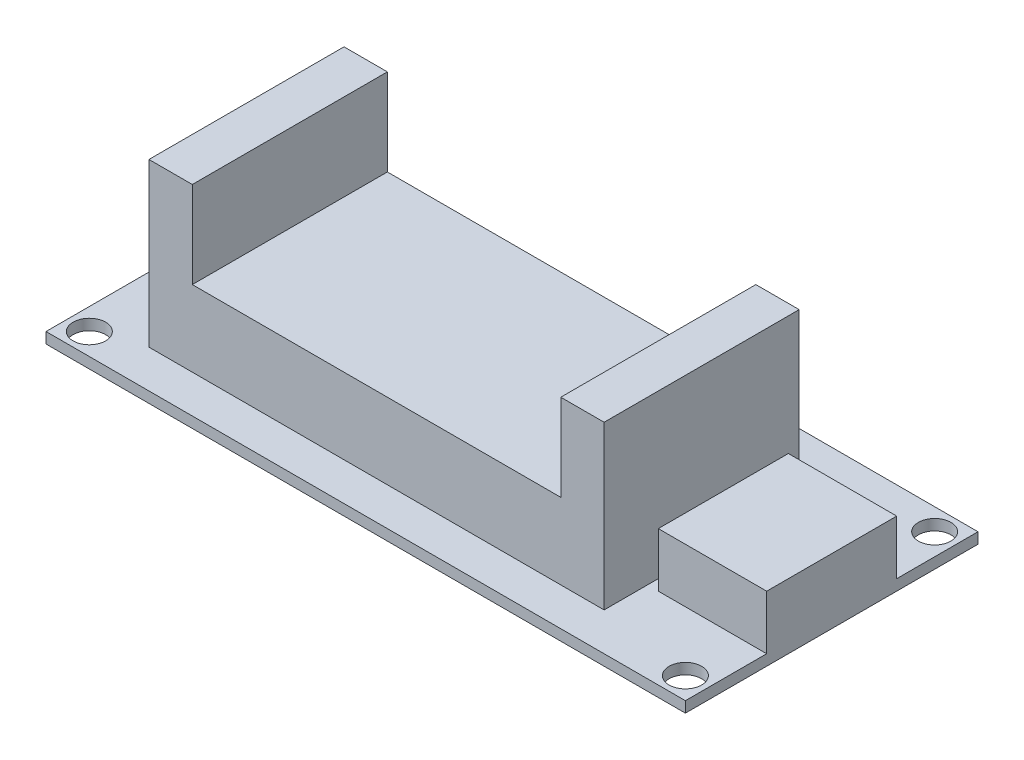
ISO-10303-21;
HEADER;
FILE_DESCRIPTION(('STEP AP214'),'2;1');
FILE_NAME('part.step','',(''),(''),'','','');
FILE_SCHEMA(('AUTOMOTIVE_DESIGN { 1 0 10303 214 1 1 1 1 }'));
ENDSEC;
DATA;
#1=APPLICATION_CONTEXT('core data for automotive mechanical design processes');
#2=APPLICATION_PROTOCOL_DEFINITION('international standard','automotive_design',2000,#1);
#3=PRODUCT_CONTEXT('',#1,'mechanical');
#4=PRODUCT('Part','Part','',(#3));
#5=PRODUCT_RELATED_PRODUCT_CATEGORY('part','',(#4));
#6=PRODUCT_DEFINITION_FORMATION('','',#4);
#7=PRODUCT_DEFINITION_CONTEXT('part definition',#1,'design');
#8=PRODUCT_DEFINITION('design','',#6,#7);
#9=PRODUCT_DEFINITION_SHAPE('','',#8);
#10=(LENGTH_UNIT() NAMED_UNIT(*) SI_UNIT(.MILLI.,.METRE.));
#11=(NAMED_UNIT(*) PLANE_ANGLE_UNIT() SI_UNIT($,.RADIAN.));
#12=(NAMED_UNIT(*) SI_UNIT($,.STERADIAN.) SOLID_ANGLE_UNIT());
#13=UNCERTAINTY_MEASURE_WITH_UNIT(LENGTH_MEASURE(1.E-05),#10,'distance_accuracy_value','');
#14=(GEOMETRIC_REPRESENTATION_CONTEXT(3) GLOBAL_UNCERTAINTY_ASSIGNED_CONTEXT((#13)) GLOBAL_UNIT_ASSIGNED_CONTEXT((#10,
#11,#12)) REPRESENTATION_CONTEXT('',''));
#15=CARTESIAN_POINT('',(0.,0.,0.));
#16=DIRECTION('',(0.,0.,1.));
#17=DIRECTION('',(1.,0.,0.));
#18=AXIS2_PLACEMENT_3D('',#15,#16,#17);
#19=CARTESIAN_POINT('',(0.,1.,0.));
#20=DIRECTION('',(0.,1.,0.));
#21=DIRECTION('',(0.,0.,1.));
#22=AXIS2_PLACEMENT_3D('',#19,#20,#21);
#23=PLANE('',#22);
#24=CARTESIAN_POINT('',(28.8082191780822,1.,-19.3057123080653));
#25=DIRECTION('',(0.,1.,0.));
#26=DIRECTION('',(0.,0.,1.));
#27=AXIS2_PLACEMENT_3D('',#24,#25,#26);
#28=CIRCLE('',#27,1.5);
#29=CARTESIAN_POINT('',(28.8082191780822,1.,-17.8057123080653));
#30=VERTEX_POINT('',#29);
#31=EDGE_CURVE('E294',#30,#30,#28,.T.);
#32=ORIENTED_EDGE('',*,*,#31,.F.);
#33=EDGE_LOOP('',(#32));
#34=FACE_BOUND('',#33,.T.);
#35=CARTESIAN_POINT('',(-26.1917808219178,1.,3.69428769193472));
#36=DIRECTION('',(0.,1.,0.));
#37=DIRECTION('',(0.,0.,1.));
#38=AXIS2_PLACEMENT_3D('',#35,#36,#37);
#39=CIRCLE('',#38,1.5);
#40=CARTESIAN_POINT('',(-26.1917808219178,1.,5.19428769193472));
#41=VERTEX_POINT('',#40);
#42=EDGE_CURVE('E306',#41,#41,#39,.T.);
#43=ORIENTED_EDGE('',*,*,#42,.F.);
#44=EDGE_LOOP('',(#43));
#45=FACE_BOUND('',#44,.T.);
#46=CARTESIAN_POINT('',(-26.1917808219178,1.,-19.3057123080653));
#47=DIRECTION('',(0.,1.,0.));
#48=DIRECTION('',(0.,0.,1.));
#49=AXIS2_PLACEMENT_3D('',#46,#47,#48);
#50=CIRCLE('',#49,1.5);
#51=CARTESIAN_POINT('',(-26.1917808219178,1.,-17.8057123080653));
#52=VERTEX_POINT('',#51);
#53=EDGE_CURVE('E300',#52,#52,#50,.T.);
#54=ORIENTED_EDGE('',*,*,#53,.F.);
#55=EDGE_LOOP('',(#54));
#56=FACE_BOUND('',#55,.T.);
#57=CARTESIAN_POINT('',(28.8082191780822,1.,3.69428769193471));
#58=DIRECTION('',(0.,1.,0.));
#59=DIRECTION('',(0.,0.,1.));
#60=AXIS2_PLACEMENT_3D('',#57,#58,#59);
#61=CIRCLE('',#60,1.5);
#62=CARTESIAN_POINT('',(28.8082191780822,1.,5.19428769193471));
#63=VERTEX_POINT('',#62);
#64=EDGE_CURVE('E288',#63,#63,#61,.T.);
#65=ORIENTED_EDGE('',*,*,#64,.F.);
#66=EDGE_LOOP('',(#65));
#67=FACE_BOUND('',#66,.T.);
#68=DIRECTION('',(0.,0.,1.));
#69=VECTOR('',#68,1.);
#70=CARTESIAN_POINT('',(-22.1917808219178,1.,-15.8057123080653));
#71=LINE('',#70,#69);
#72=CARTESIAN_POINT('',(-22.1917808219178,1.,-4.38071230806528));
#73=VERTEX_POINT('',#72);
#74=CARTESIAN_POINT('',(-22.1917808219178,1.,2.19428769193472));
#75=VERTEX_POINT('',#74);
#76=EDGE_CURVE('E247',#73,#75,#71,.T.);
#77=ORIENTED_EDGE('',*,*,#76,.F.);
#78=DIRECTION('',(1.,0.,0.));
#79=VECTOR('',#78,1.);
#80=CARTESIAN_POINT('',(-28.1917808219178,1.,-4.38071230806528));
#81=LINE('',#80,#79);
#82=CARTESIAN_POINT('',(-28.1917808219178,1.,-4.38071230806528));
#83=VERTEX_POINT('',#82);
#84=EDGE_CURVE('E409',#83,#73,#81,.T.);
#85=ORIENTED_EDGE('',*,*,#84,.F.);
#86=DIRECTION('',(0.,0.,1.));
#87=VECTOR('',#86,1.);
#88=CARTESIAN_POINT('',(-28.1917808219178,1.,-21.3057123080653));
#89=LINE('',#88,#87);
#90=CARTESIAN_POINT('',(-28.1917808219178,1.,5.69428769193472));
#91=VERTEX_POINT('',#90);
#92=EDGE_CURVE('E191',#83,#91,#89,.T.);
#93=ORIENTED_EDGE('',*,*,#92,.T.);
#94=DIRECTION('',(1.,0.,0.));
#95=VECTOR('',#94,1.);
#96=CARTESIAN_POINT('',(-28.1917808219178,1.,5.69428769193472));
#97=LINE('',#96,#95);
#98=CARTESIAN_POINT('',(30.8082191780822,1.,5.69428769193472));
#99=VERTEX_POINT('',#98);
#100=EDGE_CURVE('E315',#91,#99,#97,.T.);
#101=ORIENTED_EDGE('',*,*,#100,.T.);
#102=DIRECTION('',(0.,0.,-1.));
#103=VECTOR('',#102,1.);
#104=CARTESIAN_POINT('',(30.8082191780822,1.,-21.3057123080653));
#105=LINE('',#104,#103);
#106=CARTESIAN_POINT('',(30.8082191780822,1.,-1.80571230806528));
#107=VERTEX_POINT('',#106);
#108=EDGE_CURVE('E318',#99,#107,#105,.T.);
#109=ORIENTED_EDGE('',*,*,#108,.T.);
#110=DIRECTION('',(1.,0.,0.));
#111=VECTOR('',#110,1.);
#112=CARTESIAN_POINT('',(20.8082191780822,1.,-1.80571230806528));
#113=LINE('',#112,#111);
#114=CARTESIAN_POINT('',(20.8082191780822,1.,-1.80571230806528));
#115=VERTEX_POINT('',#114);
#116=EDGE_CURVE('E57',#115,#107,#113,.T.);
#117=ORIENTED_EDGE('',*,*,#116,.F.);
#118=DIRECTION('',(0.,0.,1.));
#119=VECTOR('',#118,1.);
#120=CARTESIAN_POINT('',(20.8082191780822,1.,-13.8057123080653));
#121=LINE('',#120,#119);
#122=CARTESIAN_POINT('',(20.8082191780822,1.,-13.8057123080653));
#123=VERTEX_POINT('',#122);
#124=EDGE_CURVE('E192',#123,#115,#121,.T.);
#125=ORIENTED_EDGE('',*,*,#124,.F.);
#126=DIRECTION('',(-1.,0.,0.));
#127=VECTOR('',#126,1.);
#128=CARTESIAN_POINT('',(20.8082191780822,1.,-13.8057123080653));
#129=LINE('',#128,#127);
#130=CARTESIAN_POINT('',(30.8082191780822,1.,-13.8057123080653));
#131=VERTEX_POINT('',#130);
#132=EDGE_CURVE('E204',#131,#123,#129,.T.);
#133=ORIENTED_EDGE('',*,*,#132,.F.);
#134=CARTESIAN_POINT('',(30.8082191780822,1.,-21.3057123080653));
#135=VERTEX_POINT('',#134);
#136=EDGE_CURVE('E317',#131,#135,#105,.T.);
#137=ORIENTED_EDGE('',*,*,#136,.T.);
#138=DIRECTION('',(-1.,0.,0.));
#139=VECTOR('',#138,1.);
#140=CARTESIAN_POINT('',(-28.1917808219178,1.,-21.3057123080653));
#141=LINE('',#140,#139);
#142=CARTESIAN_POINT('',(-28.1917808219178,1.,-21.3057123080653));
#143=VERTEX_POINT('',#142);
#144=EDGE_CURVE('E320',#135,#143,#141,.T.);
#145=ORIENTED_EDGE('',*,*,#144,.T.);
#146=CARTESIAN_POINT('',(-28.1917808219178,1.,-11.2307123080653));
#147=VERTEX_POINT('',#146);
#148=EDGE_CURVE('E312',#143,#147,#89,.T.);
#149=ORIENTED_EDGE('',*,*,#148,.T.);
#150=DIRECTION('',(-1.,0.,0.));
#151=VECTOR('',#150,1.);
#152=CARTESIAN_POINT('',(-28.1917808219178,1.,-11.2307123080653));
#153=LINE('',#152,#151);
#154=CARTESIAN_POINT('',(-22.1917808219178,1.,-11.2307123080653));
#155=VERTEX_POINT('',#154);
#156=EDGE_CURVE('E186',#155,#147,#153,.T.);
#157=ORIENTED_EDGE('',*,*,#156,.F.);
#158=CARTESIAN_POINT('',(-22.1917808219178,1.,-15.8057123080653));
#159=VERTEX_POINT('',#158);
#160=EDGE_CURVE('E252',#159,#155,#71,.T.);
#161=ORIENTED_EDGE('',*,*,#160,.F.);
#162=DIRECTION('',(-1.,0.,0.));
#163=VECTOR('',#162,1.);
#164=CARTESIAN_POINT('',(-18.1917808219178,1.,-15.8057123080653));
#165=LINE('',#164,#163);
#166=CARTESIAN_POINT('',(19.8082191780822,1.,-15.8057123080653));
#167=VERTEX_POINT('',#166);
#168=EDGE_CURVE('E276',#167,#159,#165,.T.);
#169=ORIENTED_EDGE('',*,*,#168,.F.);
#170=DIRECTION('',(0.,0.,-1.));
#171=VECTOR('',#170,1.);
#172=CARTESIAN_POINT('',(19.8082191780822,1.,-15.8057123080653));
#173=LINE('',#172,#171);
#174=CARTESIAN_POINT('',(19.8082191780822,1.,2.19428769193472));
#175=VERTEX_POINT('',#174);
#176=EDGE_CURVE('E224',#175,#167,#173,.T.);
#177=ORIENTED_EDGE('',*,*,#176,.F.);
#178=DIRECTION('',(1.,0.,0.));
#179=VECTOR('',#178,1.);
#180=CARTESIAN_POINT('',(-18.1917808219178,1.,2.19428769193472));
#181=LINE('',#180,#179);
#182=EDGE_CURVE('E271',#75,#175,#181,.T.);
#183=ORIENTED_EDGE('',*,*,#182,.F.);
#184=EDGE_LOOP('',(#77,#85,#93,#101,#109,#117,#125,#133,#137,#145,#149,#157,#161,#169,#177,#183));
#185=FACE_BOUND('',#184,.T.);
#186=ADVANCED_FACE('F34',(#34,#45,#56,#67,#185),#23,.T.);
#187=CARTESIAN_POINT('',(-22.1917808219178,16.,-15.8057123080653));
#188=DIRECTION('',(1.,0.,0.));
#189=DIRECTION('',(0.,0.,-1.));
#190=AXIS2_PLACEMENT_3D('',#187,#188,#189);
#191=PLANE('',#190);
#192=DIRECTION('',(0.,-1.,0.));
#193=VECTOR('',#192,1.);
#194=CARTESIAN_POINT('',(-22.1917808219178,2.8,-4.38071230806528));
#195=LINE('',#194,#193);
#196=CARTESIAN_POINT('',(-22.1917808219178,2.8,-4.38071230806528));
#197=VERTEX_POINT('',#196);
#198=EDGE_CURVE('E49',#197,#73,#195,.T.);
#199=ORIENTED_EDGE('',*,*,#198,.T.);
#200=ORIENTED_EDGE('',*,*,#76,.T.);
#201=DIRECTION('',(0.,-1.,0.));
#202=VECTOR('',#201,1.);
#203=CARTESIAN_POINT('',(-22.1917808219178,16.,2.19428769193472));
#204=LINE('',#203,#202);
#205=CARTESIAN_POINT('',(-22.1917808219178,16.,2.19428769193472));
#206=VERTEX_POINT('',#205);
#207=EDGE_CURVE('E262',#206,#75,#204,.T.);
#208=ORIENTED_EDGE('',*,*,#207,.F.);
#209=DIRECTION('',(0.,0.,1.));
#210=VECTOR('',#209,1.);
#211=CARTESIAN_POINT('',(-22.1917808219178,16.,-15.8057123080653));
#212=LINE('',#211,#210);
#213=CARTESIAN_POINT('',(-22.1917808219178,16.,-15.8057123080653));
#214=VERTEX_POINT('',#213);
#215=EDGE_CURVE('E254',#214,#206,#212,.T.);
#216=ORIENTED_EDGE('',*,*,#215,.F.);
#217=DIRECTION('',(0.,-1.,0.));
#218=VECTOR('',#217,1.);
#219=CARTESIAN_POINT('',(-22.1917808219178,16.,-15.8057123080653));
#220=LINE('',#219,#218);
#221=EDGE_CURVE('E265',#214,#159,#220,.T.);
#222=ORIENTED_EDGE('',*,*,#221,.T.);
#223=ORIENTED_EDGE('',*,*,#160,.T.);
#224=DIRECTION('',(0.,-1.,0.));
#225=VECTOR('',#224,1.);
#226=CARTESIAN_POINT('',(-22.1917808219178,2.8,-11.2307123080653));
#227=LINE('',#226,#225);
#228=CARTESIAN_POINT('',(-22.1917808219178,2.8,-11.2307123080653));
#229=VERTEX_POINT('',#228);
#230=EDGE_CURVE('E196',#229,#155,#227,.T.);
#231=ORIENTED_EDGE('',*,*,#230,.F.);
#232=DIRECTION('',(0.,0.,-1.));
#233=VECTOR('',#232,1.);
#234=CARTESIAN_POINT('',(-22.1917808219178,2.8,-11.2307123080653));
#235=LINE('',#234,#233);
#236=EDGE_CURVE('E176',#197,#229,#235,.T.);
#237=ORIENTED_EDGE('',*,*,#236,.F.);
#238=EDGE_LOOP('',(#199,#200,#208,#216,#222,#223,#231,#237));
#239=FACE_BOUND('',#238,.T.);
#240=ADVANCED_FACE('F385',(#239),#191,.F.);
#241=CARTESIAN_POINT('',(0.,0.,0.));
#242=DIRECTION('',(0.,1.,0.));
#243=DIRECTION('',(0.,0.,1.));
#244=AXIS2_PLACEMENT_3D('',#241,#242,#243);
#245=PLANE('',#244);
#246=DIRECTION('',(0.,0.,1.));
#247=VECTOR('',#246,1.);
#248=CARTESIAN_POINT('',(-28.1917808219178,0.,-21.3057123080653));
#249=LINE('',#248,#247);
#250=CARTESIAN_POINT('',(-28.1917808219178,0.,-21.3057123080653));
#251=VERTEX_POINT('',#250);
#252=CARTESIAN_POINT('',(-28.1917808219178,0.,5.69428769193472));
#253=VERTEX_POINT('',#252);
#254=EDGE_CURVE('E309',#251,#253,#249,.T.);
#255=ORIENTED_EDGE('',*,*,#254,.F.);
#256=DIRECTION('',(-1.,0.,0.));
#257=VECTOR('',#256,1.);
#258=CARTESIAN_POINT('',(-28.1917808219178,0.,-21.3057123080653));
#259=LINE('',#258,#257);
#260=CARTESIAN_POINT('',(30.8082191780822,0.,-21.3057123080653));
#261=VERTEX_POINT('',#260);
#262=EDGE_CURVE('E328',#261,#251,#259,.T.);
#263=ORIENTED_EDGE('',*,*,#262,.F.);
#264=DIRECTION('',(0.,0.,-1.));
#265=VECTOR('',#264,1.);
#266=CARTESIAN_POINT('',(30.8082191780822,0.,-21.3057123080653));
#267=LINE('',#266,#265);
#268=CARTESIAN_POINT('',(30.8082191780822,0.,5.69428769193472));
#269=VERTEX_POINT('',#268);
#270=EDGE_CURVE('E326',#269,#261,#267,.T.);
#271=ORIENTED_EDGE('',*,*,#270,.F.);
#272=DIRECTION('',(1.,0.,0.));
#273=VECTOR('',#272,1.);
#274=CARTESIAN_POINT('',(-28.1917808219178,0.,5.69428769193472));
#275=LINE('',#274,#273);
#276=EDGE_CURVE('E324',#253,#269,#275,.T.);
#277=ORIENTED_EDGE('',*,*,#276,.F.);
#278=EDGE_LOOP('',(#255,#263,#271,#277));
#279=FACE_BOUND('',#278,.T.);
#280=CARTESIAN_POINT('',(-26.1917808219178,0.,3.69428769193472));
#281=DIRECTION('',(0.,1.,0.));
#282=DIRECTION('',(0.,0.,1.));
#283=AXIS2_PLACEMENT_3D('',#280,#281,#282);
#284=CIRCLE('',#283,1.5);
#285=CARTESIAN_POINT('',(-26.1917808219178,0.,5.19428769193472));
#286=VERTEX_POINT('',#285);
#287=EDGE_CURVE('E303',#286,#286,#284,.T.);
#288=ORIENTED_EDGE('',*,*,#287,.T.);
#289=EDGE_LOOP('',(#288));
#290=FACE_BOUND('',#289,.T.);
#291=CARTESIAN_POINT('',(-26.1917808219178,0.,-19.3057123080653));
#292=DIRECTION('',(0.,1.,0.));
#293=DIRECTION('',(0.,0.,1.));
#294=AXIS2_PLACEMENT_3D('',#291,#292,#293);
#295=CIRCLE('',#294,1.5);
#296=CARTESIAN_POINT('',(-26.1917808219178,0.,-17.8057123080653));
#297=VERTEX_POINT('',#296);
#298=EDGE_CURVE('E297',#297,#297,#295,.T.);
#299=ORIENTED_EDGE('',*,*,#298,.T.);
#300=EDGE_LOOP('',(#299));
#301=FACE_BOUND('',#300,.T.);
#302=CARTESIAN_POINT('',(28.8082191780822,0.,-19.3057123080653));
#303=DIRECTION('',(0.,1.,0.));
#304=DIRECTION('',(0.,0.,1.));
#305=AXIS2_PLACEMENT_3D('',#302,#303,#304);
#306=CIRCLE('',#305,1.5);
#307=CARTESIAN_POINT('',(28.8082191780822,0.,-17.8057123080653));
#308=VERTEX_POINT('',#307);
#309=EDGE_CURVE('E291',#308,#308,#306,.T.);
#310=ORIENTED_EDGE('',*,*,#309,.T.);
#311=EDGE_LOOP('',(#310));
#312=FACE_BOUND('',#311,.T.);
#313=CARTESIAN_POINT('',(28.8082191780822,0.,3.69428769193471));
#314=DIRECTION('',(0.,1.,0.));
#315=DIRECTION('',(0.,0.,1.));
#316=AXIS2_PLACEMENT_3D('',#313,#314,#315);
#317=CIRCLE('',#316,1.5);
#318=CARTESIAN_POINT('',(28.8082191780822,0.,5.19428769193471));
#319=VERTEX_POINT('',#318);
#320=EDGE_CURVE('E285',#319,#319,#317,.T.);
#321=ORIENTED_EDGE('',*,*,#320,.T.);
#322=EDGE_LOOP('',(#321));
#323=FACE_BOUND('',#322,.T.);
#324=ADVANCED_FACE('F346',(#279,#290,#301,#312,#323),#245,.F.);
#325=CARTESIAN_POINT('',(-28.1917808219178,1.,-21.3057123080653));
#326=DIRECTION('',(1.,0.,0.));
#327=DIRECTION('',(0.,0.,-1.));
#328=AXIS2_PLACEMENT_3D('',#325,#326,#327);
#329=PLANE('',#328);
#330=ORIENTED_EDGE('',*,*,#254,.T.);
#331=DIRECTION('',(0.,-1.,0.));
#332=VECTOR('',#331,1.);
#333=CARTESIAN_POINT('',(-28.1917808219178,1.,5.69428769193472));
#334=LINE('',#333,#332);
#335=EDGE_CURVE('E11',#91,#253,#334,.T.);
#336=ORIENTED_EDGE('',*,*,#335,.F.);
#337=ORIENTED_EDGE('',*,*,#92,.F.);
#338=DIRECTION('',(0.,-1.,0.));
#339=VECTOR('',#338,1.);
#340=CARTESIAN_POINT('',(-28.1917808219178,2.8,-4.38071230806528));
#341=LINE('',#340,#339);
#342=CARTESIAN_POINT('',(-28.1917808219178,2.8,-4.38071230806528));
#343=VERTEX_POINT('',#342);
#344=EDGE_CURVE('E172',#343,#83,#341,.T.);
#345=ORIENTED_EDGE('',*,*,#344,.F.);
#346=DIRECTION('',(0.,0.,1.));
#347=VECTOR('',#346,1.);
#348=CARTESIAN_POINT('',(-28.1917808219178,2.8,-11.2307123080653));
#349=LINE('',#348,#347);
#350=CARTESIAN_POINT('',(-28.1917808219178,2.8,-11.2307123080653));
#351=VERTEX_POINT('',#350);
#352=EDGE_CURVE('E177',#351,#343,#349,.T.);
#353=ORIENTED_EDGE('',*,*,#352,.F.);
#354=DIRECTION('',(0.,-1.,0.));
#355=VECTOR('',#354,1.);
#356=CARTESIAN_POINT('',(-28.1917808219178,2.8,-11.2307123080653));
#357=LINE('',#356,#355);
#358=EDGE_CURVE('E353',#351,#147,#357,.T.);
#359=ORIENTED_EDGE('',*,*,#358,.T.);
#360=ORIENTED_EDGE('',*,*,#148,.F.);
#361=DIRECTION('',(0.,-1.,0.));
#362=VECTOR('',#361,1.);
#363=CARTESIAN_POINT('',(-28.1917808219178,1.,-21.3057123080653));
#364=LINE('',#363,#362);
#365=EDGE_CURVE('E322',#143,#251,#364,.T.);
#366=ORIENTED_EDGE('',*,*,#365,.T.);
#367=EDGE_LOOP('',(#330,#336,#337,#345,#353,#359,#360,#366));
#368=FACE_BOUND('',#367,.T.);
#369=ADVANCED_FACE('F36',(#368),#329,.F.);
#370=CARTESIAN_POINT('',(-28.1917808219178,1.,5.69428769193472));
#371=DIRECTION('',(0.,0.,-1.));
#372=DIRECTION('',(-1.,0.,0.));
#373=AXIS2_PLACEMENT_3D('',#370,#371,#372);
#374=PLANE('',#373);
#375=ORIENTED_EDGE('',*,*,#276,.T.);
#376=DIRECTION('',(0.,-1.,0.));
#377=VECTOR('',#376,1.);
#378=CARTESIAN_POINT('',(30.8082191780822,1.,5.69428769193472));
#379=LINE('',#378,#377);
#380=EDGE_CURVE('E42',#99,#269,#379,.T.);
#381=ORIENTED_EDGE('',*,*,#380,.F.);
#382=ORIENTED_EDGE('',*,*,#100,.F.);
#383=ORIENTED_EDGE('',*,*,#335,.T.);
#384=EDGE_LOOP('',(#375,#381,#382,#383));
#385=FACE_BOUND('',#384,.T.);
#386=ADVANCED_FACE('F404',(#385),#374,.F.);
#387=CARTESIAN_POINT('',(30.8082191780822,1.,-21.3057123080653));
#388=DIRECTION('',(-1.,0.,0.));
#389=DIRECTION('',(0.,0.,1.));
#390=AXIS2_PLACEMENT_3D('',#387,#388,#389);
#391=PLANE('',#390);
#392=ORIENTED_EDGE('',*,*,#270,.T.);
#393=DIRECTION('',(0.,-1.,0.));
#394=VECTOR('',#393,1.);
#395=CARTESIAN_POINT('',(30.8082191780822,1.,-21.3057123080653));
#396=LINE('',#395,#394);
#397=EDGE_CURVE('E332',#135,#261,#396,.T.);
#398=ORIENTED_EDGE('',*,*,#397,.F.);
#399=ORIENTED_EDGE('',*,*,#136,.F.);
#400=DIRECTION('',(0.,-1.,0.));
#401=VECTOR('',#400,1.);
#402=CARTESIAN_POINT('',(30.8082191780822,6.,-13.8057123080653));
#403=LINE('',#402,#401);
#404=CARTESIAN_POINT('',(30.8082191780822,6.,-13.8057123080653));
#405=VERTEX_POINT('',#404);
#406=EDGE_CURVE('E216',#405,#131,#403,.T.);
#407=ORIENTED_EDGE('',*,*,#406,.F.);
#408=DIRECTION('',(0.,0.,-1.));
#409=VECTOR('',#408,1.);
#410=CARTESIAN_POINT('',(30.8082191780822,6.,-13.8057123080653));
#411=LINE('',#410,#409);
#412=CARTESIAN_POINT('',(30.8082191780822,6.,-1.80571230806528));
#413=VERTEX_POINT('',#412);
#414=EDGE_CURVE('E206',#413,#405,#411,.T.);
#415=ORIENTED_EDGE('',*,*,#414,.F.);
#416=DIRECTION('',(0.,-1.,0.));
#417=VECTOR('',#416,1.);
#418=CARTESIAN_POINT('',(30.8082191780822,6.,-1.80571230806528));
#419=LINE('',#418,#417);
#420=EDGE_CURVE('E219',#413,#107,#419,.T.);
#421=ORIENTED_EDGE('',*,*,#420,.T.);
#422=ORIENTED_EDGE('',*,*,#108,.F.);
#423=ORIENTED_EDGE('',*,*,#380,.T.);
#424=EDGE_LOOP('',(#392,#398,#399,#407,#415,#421,#422,#423));
#425=FACE_BOUND('',#424,.T.);
#426=ADVANCED_FACE('F339',(#425),#391,.F.);
#427=CARTESIAN_POINT('',(-28.1917808219178,1.,-21.3057123080653));
#428=DIRECTION('',(0.,0.,1.));
#429=DIRECTION('',(1.,0.,0.));
#430=AXIS2_PLACEMENT_3D('',#427,#428,#429);
#431=PLANE('',#430);
#432=ORIENTED_EDGE('',*,*,#262,.T.);
#433=ORIENTED_EDGE('',*,*,#365,.F.);
#434=ORIENTED_EDGE('',*,*,#144,.F.);
#435=ORIENTED_EDGE('',*,*,#397,.T.);
#436=EDGE_LOOP('',(#432,#433,#434,#435));
#437=FACE_BOUND('',#436,.T.);
#438=ADVANCED_FACE('F350',(#437),#431,.F.);
#439=CARTESIAN_POINT('',(-26.1917808219178,1.,3.69428769193472));
#440=DIRECTION('',(0.,-1.,0.));
#441=DIRECTION('',(0.,0.,-1.));
#442=AXIS2_PLACEMENT_3D('',#439,#440,#441);
#443=CYLINDRICAL_SURFACE('',#442,1.5);
#444=ORIENTED_EDGE('',*,*,#42,.T.);
#445=EDGE_LOOP('',(#444));
#446=FACE_BOUND('',#445,.T.);
#447=ORIENTED_EDGE('',*,*,#287,.F.);
#448=EDGE_LOOP('',(#447));
#449=FACE_BOUND('',#448,.T.);
#450=ADVANCED_FACE('F397',(#446,#449),#443,.F.);
#451=CARTESIAN_POINT('',(-26.1917808219178,1.,-19.3057123080653));
#452=DIRECTION('',(0.,-1.,0.));
#453=DIRECTION('',(0.,0.,-1.));
#454=AXIS2_PLACEMENT_3D('',#451,#452,#453);
#455=CYLINDRICAL_SURFACE('',#454,1.5);
#456=ORIENTED_EDGE('',*,*,#53,.T.);
#457=EDGE_LOOP('',(#456));
#458=FACE_BOUND('',#457,.T.);
#459=ORIENTED_EDGE('',*,*,#298,.F.);
#460=EDGE_LOOP('',(#459));
#461=FACE_BOUND('',#460,.T.);
#462=ADVANCED_FACE('F468',(#458,#461),#455,.F.);
#463=CARTESIAN_POINT('',(28.8082191780822,1.,-19.3057123080653));
#464=DIRECTION('',(0.,-1.,0.));
#465=DIRECTION('',(0.,0.,-1.));
#466=AXIS2_PLACEMENT_3D('',#463,#464,#465);
#467=CYLINDRICAL_SURFACE('',#466,1.5);
#468=ORIENTED_EDGE('',*,*,#31,.T.);
#469=EDGE_LOOP('',(#468));
#470=FACE_BOUND('',#469,.T.);
#471=ORIENTED_EDGE('',*,*,#309,.F.);
#472=EDGE_LOOP('',(#471));
#473=FACE_BOUND('',#472,.T.);
#474=ADVANCED_FACE('F465',(#470,#473),#467,.F.);
#475=CARTESIAN_POINT('',(28.8082191780822,1.,3.69428769193471));
#476=DIRECTION('',(0.,-1.,0.));
#477=DIRECTION('',(0.,0.,-1.));
#478=AXIS2_PLACEMENT_3D('',#475,#476,#477);
#479=CYLINDRICAL_SURFACE('',#478,1.5);
#480=ORIENTED_EDGE('',*,*,#64,.T.);
#481=EDGE_LOOP('',(#480));
#482=FACE_BOUND('',#481,.T.);
#483=ORIENTED_EDGE('',*,*,#320,.F.);
#484=EDGE_LOOP('',(#483));
#485=FACE_BOUND('',#484,.T.);
#486=ADVANCED_FACE('F462',(#482,#485),#479,.F.);
#487=CARTESIAN_POINT('',(-18.1917808219178,8.,2.19428769193472));
#488=DIRECTION('',(0.,0.,-1.));
#489=DIRECTION('',(-1.,0.,0.));
#490=AXIS2_PLACEMENT_3D('',#487,#488,#489);
#491=PLANE('',#490);
#492=ORIENTED_EDGE('',*,*,#182,.T.);
#493=DIRECTION('',(0.,-1.,0.));
#494=VECTOR('',#493,1.);
#495=CARTESIAN_POINT('',(19.8082191780822,16.,2.19428769193472));
#496=LINE('',#495,#494);
#497=CARTESIAN_POINT('',(19.8082191780822,16.,2.19428769193472));
#498=VERTEX_POINT('',#497);
#499=EDGE_CURVE('E241',#498,#175,#496,.T.);
#500=ORIENTED_EDGE('',*,*,#499,.F.);
#501=DIRECTION('',(1.,0.,0.));
#502=VECTOR('',#501,1.);
#503=CARTESIAN_POINT('',(15.8082191780822,16.,2.19428769193472));
#504=LINE('',#503,#502);
#505=CARTESIAN_POINT('',(15.8082191780822,16.,2.19428769193472));
#506=VERTEX_POINT('',#505);
#507=EDGE_CURVE('E228',#506,#498,#504,.T.);
#508=ORIENTED_EDGE('',*,*,#507,.F.);
#509=DIRECTION('',(0.,-1.,0.));
#510=VECTOR('',#509,1.);
#511=CARTESIAN_POINT('',(15.8082191780822,16.,2.19428769193472));
#512=LINE('',#511,#510);
#513=CARTESIAN_POINT('',(15.8082191780822,8.,2.19428769193472));
#514=VERTEX_POINT('',#513);
#515=EDGE_CURVE('E244',#506,#514,#512,.T.);
#516=ORIENTED_EDGE('',*,*,#515,.T.);
#517=DIRECTION('',(1.,0.,0.));
#518=VECTOR('',#517,1.);
#519=CARTESIAN_POINT('',(-18.1917808219178,8.,2.19428769193472));
#520=LINE('',#519,#518);
#521=CARTESIAN_POINT('',(-18.1917808219178,8.,2.19428769193472));
#522=VERTEX_POINT('',#521);
#523=EDGE_CURVE('E275',#522,#514,#520,.T.);
#524=ORIENTED_EDGE('',*,*,#523,.F.);
#525=DIRECTION('',(0.,-1.,0.));
#526=VECTOR('',#525,1.);
#527=CARTESIAN_POINT('',(-18.1917808219178,16.,2.19428769193472));
#528=LINE('',#527,#526);
#529=CARTESIAN_POINT('',(-18.1917808219178,16.,2.19428769193472));
#530=VERTEX_POINT('',#529);
#531=EDGE_CURVE('E258',#530,#522,#528,.T.);
#532=ORIENTED_EDGE('',*,*,#531,.F.);
#533=DIRECTION('',(1.,0.,0.));
#534=VECTOR('',#533,1.);
#535=CARTESIAN_POINT('',(-18.1917808219178,16.,2.19428769193472));
#536=LINE('',#535,#534);
#537=EDGE_CURVE('E256',#206,#530,#536,.T.);
#538=ORIENTED_EDGE('',*,*,#537,.F.);
#539=ORIENTED_EDGE('',*,*,#207,.T.);
#540=EDGE_LOOP('',(#492,#500,#508,#516,#524,#532,#538,#539));
#541=FACE_BOUND('',#540,.T.);
#542=ADVANCED_FACE('F434',(#541),#491,.F.);
#543=CARTESIAN_POINT('',(-18.1917808219178,8.,-15.8057123080653));
#544=DIRECTION('',(0.,0.,1.));
#545=DIRECTION('',(1.,0.,0.));
#546=AXIS2_PLACEMENT_3D('',#543,#544,#545);
#547=PLANE('',#546);
#548=ORIENTED_EDGE('',*,*,#168,.T.);
#549=ORIENTED_EDGE('',*,*,#221,.F.);
#550=DIRECTION('',(-1.,0.,0.));
#551=VECTOR('',#550,1.);
#552=CARTESIAN_POINT('',(-18.1917808219178,16.,-15.8057123080653));
#553=LINE('',#552,#551);
#554=CARTESIAN_POINT('',(-18.1917808219178,16.,-15.8057123080653));
#555=VERTEX_POINT('',#554);
#556=EDGE_CURVE('E251',#555,#214,#553,.T.);
#557=ORIENTED_EDGE('',*,*,#556,.F.);
#558=DIRECTION('',(0.,-1.,0.));
#559=VECTOR('',#558,1.);
#560=CARTESIAN_POINT('',(-18.1917808219178,16.,-15.8057123080653));
#561=LINE('',#560,#559);
#562=CARTESIAN_POINT('',(-18.1917808219178,8.,-15.8057123080653));
#563=VERTEX_POINT('',#562);
#564=EDGE_CURVE('E268',#555,#563,#561,.T.);
#565=ORIENTED_EDGE('',*,*,#564,.T.);
#566=DIRECTION('',(-1.,0.,0.));
#567=VECTOR('',#566,1.);
#568=CARTESIAN_POINT('',(-18.1917808219178,8.,-15.8057123080653));
#569=LINE('',#568,#567);
#570=CARTESIAN_POINT('',(15.8082191780822,8.,-15.8057123080653));
#571=VERTEX_POINT('',#570);
#572=EDGE_CURVE('E282',#571,#563,#569,.T.);
#573=ORIENTED_EDGE('',*,*,#572,.F.);
#574=DIRECTION('',(0.,-1.,0.));
#575=VECTOR('',#574,1.);
#576=CARTESIAN_POINT('',(15.8082191780822,16.,-15.8057123080653));
#577=LINE('',#576,#575);
#578=CARTESIAN_POINT('',(15.8082191780822,16.,-15.8057123080653));
#579=VERTEX_POINT('',#578);
#580=EDGE_CURVE('E234',#579,#571,#577,.T.);
#581=ORIENTED_EDGE('',*,*,#580,.F.);
#582=DIRECTION('',(-1.,0.,0.));
#583=VECTOR('',#582,1.);
#584=CARTESIAN_POINT('',(15.8082191780822,16.,-15.8057123080653));
#585=LINE('',#584,#583);
#586=CARTESIAN_POINT('',(19.8082191780822,16.,-15.8057123080653));
#587=VERTEX_POINT('',#586);
#588=EDGE_CURVE('E232',#587,#579,#585,.T.);
#589=ORIENTED_EDGE('',*,*,#588,.F.);
#590=DIRECTION('',(0.,-1.,0.));
#591=VECTOR('',#590,1.);
#592=CARTESIAN_POINT('',(19.8082191780822,16.,-15.8057123080653));
#593=LINE('',#592,#591);
#594=EDGE_CURVE('E238',#587,#167,#593,.T.);
#595=ORIENTED_EDGE('',*,*,#594,.T.);
#596=EDGE_LOOP('',(#548,#549,#557,#565,#573,#581,#589,#595));
#597=FACE_BOUND('',#596,.T.);
#598=ADVANCED_FACE('F428',(#597),#547,.F.);
#599=CARTESIAN_POINT('',(0.,8.,0.));
#600=DIRECTION('',(0.,1.,0.));
#601=DIRECTION('',(0.,0.,1.));
#602=AXIS2_PLACEMENT_3D('',#599,#600,#601);
#603=PLANE('',#602);
#604=DIRECTION('',(0.,0.,1.));
#605=VECTOR('',#604,1.);
#606=CARTESIAN_POINT('',(-18.1917808219178,8.,-15.8057123080653));
#607=LINE('',#606,#605);
#608=EDGE_CURVE('E272',#563,#522,#607,.T.);
#609=ORIENTED_EDGE('',*,*,#608,.T.);
#610=ORIENTED_EDGE('',*,*,#523,.T.);
#611=DIRECTION('',(0.,0.,-1.));
#612=VECTOR('',#611,1.);
#613=CARTESIAN_POINT('',(15.8082191780822,8.,-15.8057123080653));
#614=LINE('',#613,#612);
#615=EDGE_CURVE('E279',#514,#571,#614,.T.);
#616=ORIENTED_EDGE('',*,*,#615,.T.);
#617=ORIENTED_EDGE('',*,*,#572,.T.);
#618=EDGE_LOOP('',(#609,#610,#616,#617));
#619=FACE_BOUND('',#618,.T.);
#620=ADVANCED_FACE('F444',(#619),#603,.T.);
#621=CARTESIAN_POINT('',(-18.1917808219178,16.,-15.8057123080653));
#622=DIRECTION('',(-1.,0.,0.));
#623=DIRECTION('',(0.,0.,1.));
#624=AXIS2_PLACEMENT_3D('',#621,#622,#623);
#625=PLANE('',#624);
#626=ORIENTED_EDGE('',*,*,#608,.F.);
#627=ORIENTED_EDGE('',*,*,#564,.F.);
#628=DIRECTION('',(0.,0.,-1.));
#629=VECTOR('',#628,1.);
#630=CARTESIAN_POINT('',(-18.1917808219178,16.,-15.8057123080653));
#631=LINE('',#630,#629);
#632=EDGE_CURVE('E248',#530,#555,#631,.T.);
#633=ORIENTED_EDGE('',*,*,#632,.F.);
#634=ORIENTED_EDGE('',*,*,#531,.T.);
#635=EDGE_LOOP('',(#626,#627,#633,#634));
#636=FACE_BOUND('',#635,.T.);
#637=ADVANCED_FACE('F448',(#636),#625,.F.);
#638=CARTESIAN_POINT('',(0.,16.,0.));
#639=DIRECTION('',(0.,-1.,0.));
#640=DIRECTION('',(0.,0.,-1.));
#641=AXIS2_PLACEMENT_3D('',#638,#639,#640);
#642=PLANE('',#641);
#643=ORIENTED_EDGE('',*,*,#632,.T.);
#644=ORIENTED_EDGE('',*,*,#556,.T.);
#645=ORIENTED_EDGE('',*,*,#215,.T.);
#646=ORIENTED_EDGE('',*,*,#537,.T.);
#647=EDGE_LOOP('',(#643,#644,#645,#646));
#648=FACE_BOUND('',#647,.T.);
#649=ADVANCED_FACE('F439',(#648),#642,.F.);
#650=CARTESIAN_POINT('',(15.8082191780822,16.,-15.8057123080653));
#651=DIRECTION('',(1.,0.,0.));
#652=DIRECTION('',(0.,0.,-1.));
#653=AXIS2_PLACEMENT_3D('',#650,#651,#652);
#654=PLANE('',#653);
#655=ORIENTED_EDGE('',*,*,#615,.F.);
#656=ORIENTED_EDGE('',*,*,#515,.F.);
#657=DIRECTION('',(0.,0.,1.));
#658=VECTOR('',#657,1.);
#659=CARTESIAN_POINT('',(15.8082191780822,16.,-15.8057123080653));
#660=LINE('',#659,#658);
#661=EDGE_CURVE('E225',#579,#506,#660,.T.);
#662=ORIENTED_EDGE('',*,*,#661,.F.);
#663=ORIENTED_EDGE('',*,*,#580,.T.);
#664=EDGE_LOOP('',(#655,#656,#662,#663));
#665=FACE_BOUND('',#664,.T.);
#666=ADVANCED_FACE('F447',(#665),#654,.F.);
#667=CARTESIAN_POINT('',(19.8082191780822,16.,-15.8057123080653));
#668=DIRECTION('',(-1.,0.,0.));
#669=DIRECTION('',(0.,0.,1.));
#670=AXIS2_PLACEMENT_3D('',#667,#668,#669);
#671=PLANE('',#670);
#672=ORIENTED_EDGE('',*,*,#176,.T.);
#673=ORIENTED_EDGE('',*,*,#594,.F.);
#674=DIRECTION('',(0.,0.,-1.));
#675=VECTOR('',#674,1.);
#676=CARTESIAN_POINT('',(19.8082191780822,16.,-15.8057123080653));
#677=LINE('',#676,#675);
#678=EDGE_CURVE('E230',#498,#587,#677,.T.);
#679=ORIENTED_EDGE('',*,*,#678,.F.);
#680=ORIENTED_EDGE('',*,*,#499,.T.);
#681=EDGE_LOOP('',(#672,#673,#679,#680));
#682=FACE_BOUND('',#681,.T.);
#683=ADVANCED_FACE('F381',(#682),#671,.F.);
#684=CARTESIAN_POINT('',(0.,16.,0.));
#685=DIRECTION('',(0.,1.,0.));
#686=DIRECTION('',(0.,0.,1.));
#687=AXIS2_PLACEMENT_3D('',#684,#685,#686);
#688=PLANE('',#687);
#689=ORIENTED_EDGE('',*,*,#661,.T.);
#690=ORIENTED_EDGE('',*,*,#507,.T.);
#691=ORIENTED_EDGE('',*,*,#678,.T.);
#692=ORIENTED_EDGE('',*,*,#588,.T.);
#693=EDGE_LOOP('',(#689,#690,#691,#692));
#694=FACE_BOUND('',#693,.T.);
#695=ADVANCED_FACE('F374',(#694),#688,.T.);
#696=CARTESIAN_POINT('',(20.8082191780822,6.,-13.8057123080653));
#697=DIRECTION('',(1.,0.,0.));
#698=DIRECTION('',(0.,0.,-1.));
#699=AXIS2_PLACEMENT_3D('',#696,#697,#698);
#700=PLANE('',#699);
#701=ORIENTED_EDGE('',*,*,#124,.T.);
#702=DIRECTION('',(0.,-1.,0.));
#703=VECTOR('',#702,1.);
#704=CARTESIAN_POINT('',(20.8082191780822,6.,-1.80571230806528));
#705=LINE('',#704,#703);
#706=CARTESIAN_POINT('',(20.8082191780822,6.,-1.80571230806528));
#707=VERTEX_POINT('',#706);
#708=EDGE_CURVE('E222',#707,#115,#705,.T.);
#709=ORIENTED_EDGE('',*,*,#708,.F.);
#710=DIRECTION('',(0.,0.,1.));
#711=VECTOR('',#710,1.);
#712=CARTESIAN_POINT('',(20.8082191780822,6.,-13.8057123080653));
#713=LINE('',#712,#711);
#714=CARTESIAN_POINT('',(20.8082191780822,6.,-13.8057123080653));
#715=VERTEX_POINT('',#714);
#716=EDGE_CURVE('E200',#715,#707,#713,.T.);
#717=ORIENTED_EDGE('',*,*,#716,.F.);
#718=DIRECTION('',(0.,-1.,0.));
#719=VECTOR('',#718,1.);
#720=CARTESIAN_POINT('',(20.8082191780822,6.,-13.8057123080653));
#721=LINE('',#720,#719);
#722=EDGE_CURVE('E209',#715,#123,#721,.T.);
#723=ORIENTED_EDGE('',*,*,#722,.T.);
#724=EDGE_LOOP('',(#701,#709,#717,#723));
#725=FACE_BOUND('',#724,.T.);
#726=ADVANCED_FACE('F372',(#725),#700,.F.);
#727=CARTESIAN_POINT('',(20.8082191780822,6.,-1.80571230806528));
#728=DIRECTION('',(0.,0.,-1.));
#729=DIRECTION('',(-1.,0.,0.));
#730=AXIS2_PLACEMENT_3D('',#727,#728,#729);
#731=PLANE('',#730);
#732=ORIENTED_EDGE('',*,*,#116,.T.);
#733=ORIENTED_EDGE('',*,*,#420,.F.);
#734=DIRECTION('',(1.,0.,0.));
#735=VECTOR('',#734,1.);
#736=CARTESIAN_POINT('',(20.8082191780822,6.,-1.80571230806528));
#737=LINE('',#736,#735);
#738=EDGE_CURVE('E203',#707,#413,#737,.T.);
#739=ORIENTED_EDGE('',*,*,#738,.F.);
#740=ORIENTED_EDGE('',*,*,#708,.T.);
#741=EDGE_LOOP('',(#732,#733,#739,#740));
#742=FACE_BOUND('',#741,.T.);
#743=ADVANCED_FACE('F370',(#742),#731,.F.);
#744=CARTESIAN_POINT('',(20.8082191780822,6.,-13.8057123080653));
#745=DIRECTION('',(0.,0.,1.));
#746=DIRECTION('',(1.,0.,0.));
#747=AXIS2_PLACEMENT_3D('',#744,#745,#746);
#748=PLANE('',#747);
#749=ORIENTED_EDGE('',*,*,#132,.T.);
#750=ORIENTED_EDGE('',*,*,#722,.F.);
#751=DIRECTION('',(-1.,0.,0.));
#752=VECTOR('',#751,1.);
#753=CARTESIAN_POINT('',(20.8082191780822,6.,-13.8057123080653));
#754=LINE('',#753,#752);
#755=EDGE_CURVE('E208',#405,#715,#754,.T.);
#756=ORIENTED_EDGE('',*,*,#755,.F.);
#757=ORIENTED_EDGE('',*,*,#406,.T.);
#758=EDGE_LOOP('',(#749,#750,#756,#757));
#759=FACE_BOUND('',#758,.T.);
#760=ADVANCED_FACE('F363',(#759),#748,.F.);
#761=CARTESIAN_POINT('',(0.,6.,0.));
#762=DIRECTION('',(0.,1.,0.));
#763=DIRECTION('',(0.,0.,1.));
#764=AXIS2_PLACEMENT_3D('',#761,#762,#763);
#765=PLANE('',#764);
#766=ORIENTED_EDGE('',*,*,#716,.T.);
#767=ORIENTED_EDGE('',*,*,#738,.T.);
#768=ORIENTED_EDGE('',*,*,#414,.T.);
#769=ORIENTED_EDGE('',*,*,#755,.T.);
#770=EDGE_LOOP('',(#766,#767,#768,#769));
#771=FACE_BOUND('',#770,.T.);
#772=ADVANCED_FACE('F366',(#771),#765,.T.);
#773=CARTESIAN_POINT('',(-28.1917808219178,2.8,-4.38071230806528));
#774=DIRECTION('',(0.,0.,-1.));
#775=DIRECTION('',(-1.,0.,0.));
#776=AXIS2_PLACEMENT_3D('',#773,#774,#775);
#777=PLANE('',#776);
#778=ORIENTED_EDGE('',*,*,#84,.T.);
#779=ORIENTED_EDGE('',*,*,#198,.F.);
#780=DIRECTION('',(1.,0.,0.));
#781=VECTOR('',#780,1.);
#782=CARTESIAN_POINT('',(-28.1917808219178,2.8,-4.38071230806528));
#783=LINE('',#782,#781);
#784=EDGE_CURVE('E168',#343,#197,#783,.T.);
#785=ORIENTED_EDGE('',*,*,#784,.F.);
#786=ORIENTED_EDGE('',*,*,#344,.T.);
#787=EDGE_LOOP('',(#778,#779,#785,#786));
#788=FACE_BOUND('',#787,.T.);
#789=ADVANCED_FACE('F170',(#788),#777,.F.);
#790=CARTESIAN_POINT('',(-28.1917808219178,2.8,-11.2307123080653));
#791=DIRECTION('',(0.,0.,1.));
#792=DIRECTION('',(1.,0.,0.));
#793=AXIS2_PLACEMENT_3D('',#790,#791,#792);
#794=PLANE('',#793);
#795=ORIENTED_EDGE('',*,*,#156,.T.);
#796=ORIENTED_EDGE('',*,*,#358,.F.);
#797=DIRECTION('',(-1.,0.,0.));
#798=VECTOR('',#797,1.);
#799=CARTESIAN_POINT('',(-28.1917808219178,2.8,-11.2307123080653));
#800=LINE('',#799,#798);
#801=EDGE_CURVE('E182',#229,#351,#800,.T.);
#802=ORIENTED_EDGE('',*,*,#801,.F.);
#803=ORIENTED_EDGE('',*,*,#230,.T.);
#804=EDGE_LOOP('',(#795,#796,#802,#803));
#805=FACE_BOUND('',#804,.T.);
#806=ADVANCED_FACE('F418',(#805),#794,.F.);
#807=CARTESIAN_POINT('',(0.,2.8,0.));
#808=DIRECTION('',(0.,1.,0.));
#809=DIRECTION('',(0.,0.,1.));
#810=AXIS2_PLACEMENT_3D('',#807,#808,#809);
#811=PLANE('',#810);
#812=ORIENTED_EDGE('',*,*,#352,.T.);
#813=ORIENTED_EDGE('',*,*,#784,.T.);
#814=ORIENTED_EDGE('',*,*,#236,.T.);
#815=ORIENTED_EDGE('',*,*,#801,.T.);
#816=EDGE_LOOP('',(#812,#813,#814,#815));
#817=FACE_BOUND('',#816,.T.);
#818=ADVANCED_FACE('F180',(#817),#811,.T.);
#819=CLOSED_SHELL('',(#186,#240,#324,#369,#386,#426,#438,#450,#462,#474,#486,#542,#598,#620,
#637,#649,#666,#683,#695,#726,#743,#760,#772,#789,#806,#818));
#820=MANIFOLD_SOLID_BREP('B2',#819);
#821=ADVANCED_BREP_SHAPE_REPRESENTATION('',(#18,#820),#14);
#822=SHAPE_DEFINITION_REPRESENTATION(#9,#821);
ENDSEC;
END-ISO-10303-21;
